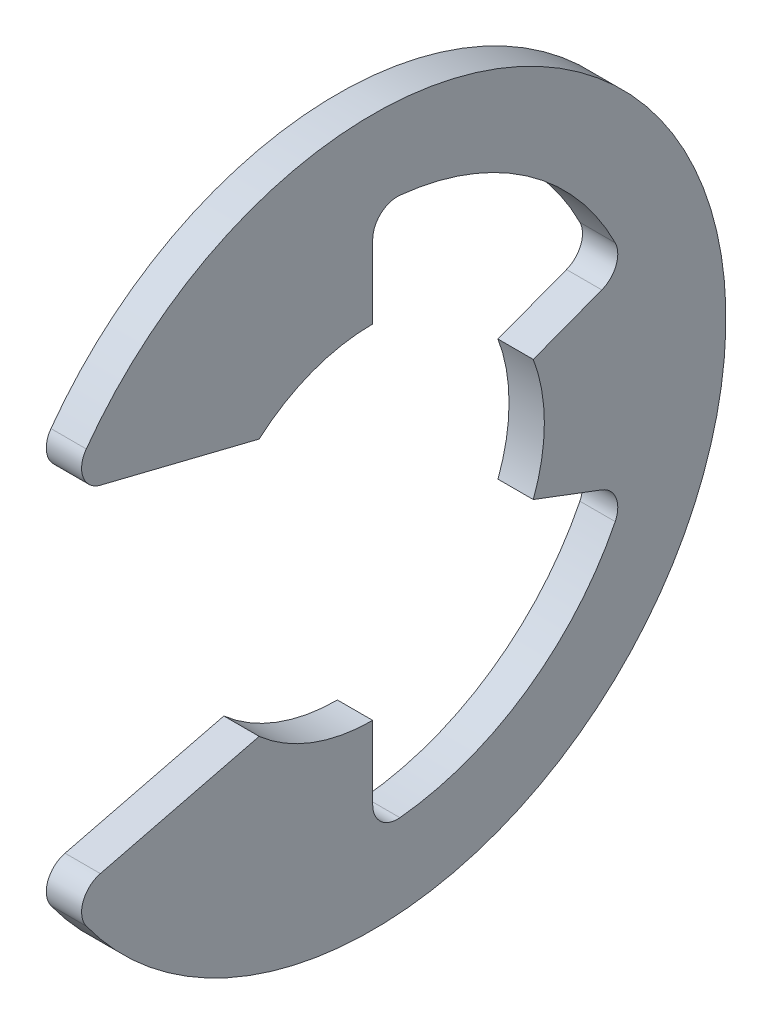
ISO-10303-21;
HEADER;
FILE_DESCRIPTION(('STEP AP214'),'2;1');
FILE_NAME('part.step','',(''),(''),'','','');
FILE_SCHEMA(('AUTOMOTIVE_DESIGN { 1 0 10303 214 1 1 1 1 }'));
ENDSEC;
DATA;
#1=APPLICATION_CONTEXT('core data for automotive mechanical design processes');
#2=APPLICATION_PROTOCOL_DEFINITION('international standard','automotive_design',2000,#1);
#3=PRODUCT_CONTEXT('',#1,'mechanical');
#4=PRODUCT('Part','Part','',(#3));
#5=PRODUCT_RELATED_PRODUCT_CATEGORY('part','',(#4));
#6=PRODUCT_DEFINITION_FORMATION('','',#4);
#7=PRODUCT_DEFINITION_CONTEXT('part definition',#1,'design');
#8=PRODUCT_DEFINITION('design','',#6,#7);
#9=PRODUCT_DEFINITION_SHAPE('','',#8);
#10=(LENGTH_UNIT() NAMED_UNIT(*) SI_UNIT(.MILLI.,.METRE.));
#11=(NAMED_UNIT(*) PLANE_ANGLE_UNIT() SI_UNIT($,.RADIAN.));
#12=(NAMED_UNIT(*) SI_UNIT($,.STERADIAN.) SOLID_ANGLE_UNIT());
#13=UNCERTAINTY_MEASURE_WITH_UNIT(LENGTH_MEASURE(1.E-05),#10,'distance_accuracy_value','');
#14=(GEOMETRIC_REPRESENTATION_CONTEXT(3) GLOBAL_UNCERTAINTY_ASSIGNED_CONTEXT((#13)) GLOBAL_UNIT_ASSIGNED_CONTEXT((#10,
#11,#12)) REPRESENTATION_CONTEXT('',''));
#15=CARTESIAN_POINT('',(0.,0.,0.));
#16=DIRECTION('',(0.,0.,1.));
#17=DIRECTION('',(1.,0.,0.));
#18=AXIS2_PLACEMENT_3D('',#15,#16,#17);
#19=CARTESIAN_POINT('',(0.3175,0.,0.));
#20=DIRECTION('',(1.,0.,0.));
#21=DIRECTION('',(0.,0.,-1.));
#22=AXIS2_PLACEMENT_3D('',#19,#20,#21);
#23=PLANE('',#22);
#24=DIRECTION('',(0.,-1.,0.));
#25=VECTOR('',#24,1.);
#26=CARTESIAN_POINT('',(0.3175,-3.0861,0.));
#27=LINE('',#26,#25);
#28=CARTESIAN_POINT('',(0.3175,-4.40336689167331,0.));
#29=VERTEX_POINT('',#28);
#30=CARTESIAN_POINT('',(0.3175,-3.0861,0.));
#31=VERTEX_POINT('',#30);
#32=EDGE_CURVE('E167',#29,#31,#27,.F.);
#33=ORIENTED_EDGE('',*,*,#32,.T.);
#34=CARTESIAN_POINT('',(0.3175,0.,0.));
#35=DIRECTION('',(-1.,0.,0.));
#36=DIRECTION('',(0.,0.,1.));
#37=AXIS2_PLACEMENT_3D('',#34,#35,#36);
#38=CIRCLE('',#37,3.0861);
#39=CARTESIAN_POINT('',(0.3175,-2.314575,2.04126328026911));
#40=VERTEX_POINT('',#39);
#41=EDGE_CURVE('E223',#31,#40,#38,.T.);
#42=ORIENTED_EDGE('',*,*,#41,.T.);
#43=DIRECTION('',(0.,0.240952820606873,-0.970536829925373));
#44=VECTOR('',#43,1.);
#45=CARTESIAN_POINT('',(0.3175,-3.17332392884383,5.5002286536677));
#46=LINE('',#45,#44);
#47=CARTESIAN_POINT('',(0.3175,-3.02345270202051,4.89656049567819));
#48=VERTEX_POINT('',#47);
#49=EDGE_CURVE('E162',#40,#48,#46,.F.);
#50=ORIENTED_EDGE('',*,*,#49,.T.);
#51=CARTESIAN_POINT('',(0.3175,-3.45485632292234,4.78945696691844));
#52=DIRECTION('',(-1.,0.,0.));
#53=DIRECTION('',(0.,0.,1.));
#54=AXIS2_PLACEMENT_3D('',#51,#52,#53);
#55=CIRCLE('',#54,0.4445);
#56=CARTESIAN_POINT('',(0.3175,-3.7148992719595,5.14995372786929));
#57=VERTEX_POINT('',#56);
#58=EDGE_CURVE('E221',#57,#48,#55,.T.);
#59=ORIENTED_EDGE('',*,*,#58,.F.);
#60=CARTESIAN_POINT('',(0.3175,0.,0.));
#61=DIRECTION('',(-1.,0.,0.));
#62=DIRECTION('',(0.,0.,1.));
#63=AXIS2_PLACEMENT_3D('',#60,#61,#62);
#64=CIRCLE('',#63,6.35);
#65=CARTESIAN_POINT('',(0.3175,3.7148992719595,5.14995372786929));
#66=VERTEX_POINT('',#65);
#67=EDGE_CURVE('E142',#66,#57,#64,.T.);
#68=ORIENTED_EDGE('',*,*,#67,.F.);
#69=CARTESIAN_POINT('',(0.3175,3.45485632292234,4.78945696691844));
#70=DIRECTION('',(-1.,0.,0.));
#71=DIRECTION('',(0.,0.,1.));
#72=AXIS2_PLACEMENT_3D('',#69,#70,#71);
#73=CIRCLE('',#72,0.4445);
#74=CARTESIAN_POINT('',(0.3175,3.02345270202051,4.89656049567819));
#75=VERTEX_POINT('',#74);
#76=EDGE_CURVE('E20',#75,#66,#73,.T.);
#77=ORIENTED_EDGE('',*,*,#76,.F.);
#78=DIRECTION('',(0.,0.240952820606873,0.970536829925373));
#79=VECTOR('',#78,1.);
#80=CARTESIAN_POINT('',(0.3175,3.17332392884382,5.5002286536677));
#81=LINE('',#80,#79);
#82=CARTESIAN_POINT('',(0.3175,2.314575,2.04126328026911));
#83=VERTEX_POINT('',#82);
#84=EDGE_CURVE('E139',#75,#83,#81,.F.);
#85=ORIENTED_EDGE('',*,*,#84,.T.);
#86=CARTESIAN_POINT('',(0.3175,0.,0.));
#87=DIRECTION('',(-1.,0.,0.));
#88=DIRECTION('',(0.,0.,1.));
#89=AXIS2_PLACEMENT_3D('',#86,#87,#88);
#90=CIRCLE('',#89,3.0861);
#91=CARTESIAN_POINT('',(0.3175,3.0861,0.));
#92=VERTEX_POINT('',#91);
#93=EDGE_CURVE('E242',#83,#92,#90,.T.);
#94=ORIENTED_EDGE('',*,*,#93,.T.);
#95=DIRECTION('',(0.,-1.,0.));
#96=VECTOR('',#95,1.);
#97=CARTESIAN_POINT('',(0.3175,3.0861,0.));
#98=LINE('',#97,#96);
#99=CARTESIAN_POINT('',(0.3175,4.40336689167331,0.));
#100=VERTEX_POINT('',#99);
#101=EDGE_CURVE('E179',#92,#100,#98,.F.);
#102=ORIENTED_EDGE('',*,*,#101,.T.);
#103=CARTESIAN_POINT('',(0.3175,4.40336689167331,-0.444499999999999));
#104=DIRECTION('',(-1.,0.,0.));
#105=DIRECTION('',(0.,0.,1.));
#106=AXIS2_PLACEMENT_3D('',#103,#104,#105);
#107=CIRCLE('',#106,0.4445);
#108=CARTESIAN_POINT('',(0.3175,4.84561932872465,-0.489143386096454));
#109=VERTEX_POINT('',#108);
#110=EDGE_CURVE('E241',#100,#109,#107,.T.);
#111=ORIENTED_EDGE('',*,*,#110,.T.);
#112=CARTESIAN_POINT('',(0.3175,0.,0.));
#113=DIRECTION('',(-1.,0.,0.));
#114=DIRECTION('',(0.,0.,1.));
#115=AXIS2_PLACEMENT_3D('',#112,#113,#114);
#116=CIRCLE('',#115,4.87024516129032);
#117=CARTESIAN_POINT('',(0.3175,2.17073688413976,-4.35972353606361));
#118=VERTEX_POINT('',#117);
#119=EDGE_CURVE('E238',#109,#118,#116,.T.);
#120=ORIENTED_EDGE('',*,*,#119,.T.);
#121=CARTESIAN_POINT('',(0.3175,1.97261697168252,-3.96181808210761));
#122=DIRECTION('',(-1.,0.,0.));
#123=DIRECTION('',(0.,0.,1.));
#124=AXIS2_PLACEMENT_3D('',#121,#122,#123);
#125=CIRCLE('',#124,0.4445);
#126=CARTESIAN_POINT('',(0.3175,1.55682529457727,-4.11897256422632));
#127=VERTEX_POINT('',#126);
#128=EDGE_CURVE('E235',#118,#127,#125,.T.);
#129=ORIENTED_EDGE('',*,*,#128,.T.);
#130=DIRECTION('',(0.,0.353553390593274,-0.935414346693485));
#131=VECTOR('',#130,1.);
#132=CARTESIAN_POINT('',(0.3175,1.0911011187099,-2.88678221533076));
#133=LINE('',#132,#131);
#134=CARTESIAN_POINT('',(0.3175,1.0911011187099,-2.88678221533077));
#135=VERTEX_POINT('',#134);
#136=EDGE_CURVE('E175',#127,#135,#133,.F.);
#137=ORIENTED_EDGE('',*,*,#136,.T.);
#138=CARTESIAN_POINT('',(0.3175,0.,0.));
#139=DIRECTION('',(-1.,0.,0.));
#140=DIRECTION('',(0.,0.,1.));
#141=AXIS2_PLACEMENT_3D('',#138,#139,#140);
#142=CIRCLE('',#141,3.0861);
#143=CARTESIAN_POINT('',(0.3175,-1.0911011187099,-2.88678221533077));
#144=VERTEX_POINT('',#143);
#145=EDGE_CURVE('E233',#135,#144,#142,.T.);
#146=ORIENTED_EDGE('',*,*,#145,.T.);
#147=DIRECTION('',(0.,0.353553390593274,0.935414346693485));
#148=VECTOR('',#147,1.);
#149=CARTESIAN_POINT('',(0.3175,-1.0911011187099,-2.88678221533077));
#150=LINE('',#149,#148);
#151=CARTESIAN_POINT('',(0.3175,-1.55682529457726,-4.11897256422632));
#152=VERTEX_POINT('',#151);
#153=EDGE_CURVE('E171',#144,#152,#150,.F.);
#154=ORIENTED_EDGE('',*,*,#153,.T.);
#155=CARTESIAN_POINT('',(0.3175,-1.97261697168252,-3.96181808210761));
#156=DIRECTION('',(-1.,0.,0.));
#157=DIRECTION('',(0.,0.,1.));
#158=AXIS2_PLACEMENT_3D('',#155,#156,#157);
#159=CIRCLE('',#158,0.4445);
#160=CARTESIAN_POINT('',(0.3175,-2.17073688413975,-4.35972353606361));
#161=VERTEX_POINT('',#160);
#162=EDGE_CURVE('E231',#152,#161,#159,.T.);
#163=ORIENTED_EDGE('',*,*,#162,.T.);
#164=CARTESIAN_POINT('',(0.3175,0.,0.));
#165=DIRECTION('',(-1.,0.,0.));
#166=DIRECTION('',(0.,0.,1.));
#167=AXIS2_PLACEMENT_3D('',#164,#165,#166);
#168=CIRCLE('',#167,4.87024516129032);
#169=CARTESIAN_POINT('',(0.3175,-4.84561932872465,-0.489143386096455));
#170=VERTEX_POINT('',#169);
#171=EDGE_CURVE('E228',#161,#170,#168,.T.);
#172=ORIENTED_EDGE('',*,*,#171,.T.);
#173=CARTESIAN_POINT('',(0.3175,-4.40336689167331,-0.4445));
#174=DIRECTION('',(-1.,0.,0.));
#175=DIRECTION('',(0.,0.,1.));
#176=AXIS2_PLACEMENT_3D('',#173,#174,#175);
#177=CIRCLE('',#176,0.4445);
#178=EDGE_CURVE('E225',#170,#29,#177,.T.);
#179=ORIENTED_EDGE('',*,*,#178,.T.);
#180=EDGE_LOOP('',(#33,#42,#50,#59,#68,#77,#85,#94,#102,#111,#120,#129,#137,#146,#154,#163,#172,#179));
#181=FACE_BOUND('',#180,.T.);
#182=ADVANCED_FACE('F17',(#181),#23,.T.);
#183=CARTESIAN_POINT('',(0.3175,3.45485632292234,4.78945696691844));
#184=DIRECTION('',(-1.,0.,0.));
#185=DIRECTION('',(0.,0.,1.));
#186=AXIS2_PLACEMENT_3D('',#183,#184,#185);
#187=CYLINDRICAL_SURFACE('',#186,0.4445);
#188=CARTESIAN_POINT('',(-0.3175,3.45485632292234,4.78945696691844));
#189=DIRECTION('',(-1.,0.,0.));
#190=DIRECTION('',(0.,0.,1.));
#191=AXIS2_PLACEMENT_3D('',#188,#189,#190);
#192=CIRCLE('',#191,0.4445);
#193=CARTESIAN_POINT('',(-0.3175,3.7148992719595,5.14995372786929));
#194=VERTEX_POINT('',#193);
#195=CARTESIAN_POINT('',(-0.3175,3.02345270202051,4.89656049567819));
#196=VERTEX_POINT('',#195);
#197=EDGE_CURVE('E157',#194,#196,#192,.F.);
#198=ORIENTED_EDGE('',*,*,#197,.T.);
#199=DIRECTION('',(1.,0.,0.));
#200=VECTOR('',#199,1.);
#201=CARTESIAN_POINT('',(0.3175,3.02345270202051,4.89656049567819));
#202=LINE('',#201,#200);
#203=EDGE_CURVE('E147',#196,#75,#202,.T.);
#204=ORIENTED_EDGE('',*,*,#203,.T.);
#205=ORIENTED_EDGE('',*,*,#76,.T.);
#206=DIRECTION('',(-1.,0.,0.));
#207=VECTOR('',#206,1.);
#208=CARTESIAN_POINT('',(0.3175,3.7148992719595,5.14995372786929));
#209=LINE('',#208,#207);
#210=EDGE_CURVE('E218',#194,#66,#209,.F.);
#211=ORIENTED_EDGE('',*,*,#210,.F.);
#212=EDGE_LOOP('',(#198,#204,#205,#211));
#213=FACE_BOUND('',#212,.T.);
#214=ADVANCED_FACE('F156',(#213),#187,.T.);
#215=CARTESIAN_POINT('',(0.3175,3.17332392884382,5.5002286536677));
#216=DIRECTION('',(0.,0.970536829925373,-0.240952820606873));
#217=DIRECTION('',(0.,0.240952820606873,0.970536829925373));
#218=AXIS2_PLACEMENT_3D('',#215,#216,#217);
#219=PLANE('',#218);
#220=ORIENTED_EDGE('',*,*,#203,.F.);
#221=DIRECTION('',(0.,-0.240952820606873,-0.970536829925373));
#222=VECTOR('',#221,1.);
#223=CARTESIAN_POINT('',(-0.3175,3.02345270202051,4.89656049567819));
#224=LINE('',#223,#222);
#225=CARTESIAN_POINT('',(-0.3175,2.314575,2.04126328026911));
#226=VERTEX_POINT('',#225);
#227=EDGE_CURVE('E216',#196,#226,#224,.T.);
#228=ORIENTED_EDGE('',*,*,#227,.T.);
#229=DIRECTION('',(-1.,0.,0.));
#230=VECTOR('',#229,1.);
#231=CARTESIAN_POINT('',(0.3175,2.314575,2.04126328026911));
#232=LINE('',#231,#230);
#233=EDGE_CURVE('E154',#226,#83,#232,.F.);
#234=ORIENTED_EDGE('',*,*,#233,.T.);
#235=ORIENTED_EDGE('',*,*,#84,.F.);
#236=EDGE_LOOP('',(#220,#228,#234,#235));
#237=FACE_BOUND('',#236,.T.);
#238=ADVANCED_FACE('F151',(#237),#219,.F.);
#239=CARTESIAN_POINT('',(0.3175,0.,0.));
#240=DIRECTION('',(-1.,0.,0.));
#241=DIRECTION('',(0.,0.,1.));
#242=AXIS2_PLACEMENT_3D('',#239,#240,#241);
#243=CYLINDRICAL_SURFACE('',#242,3.0861);
#244=DIRECTION('',(1.,0.,0.));
#245=VECTOR('',#244,1.);
#246=CARTESIAN_POINT('',(0.3175,3.0861,0.));
#247=LINE('',#246,#245);
#248=CARTESIAN_POINT('',(-0.3175,3.0861,0.));
#249=VERTEX_POINT('',#248);
#250=EDGE_CURVE('E181',#249,#92,#247,.T.);
#251=ORIENTED_EDGE('',*,*,#250,.T.);
#252=ORIENTED_EDGE('',*,*,#93,.F.);
#253=ORIENTED_EDGE('',*,*,#233,.F.);
#254=CARTESIAN_POINT('',(-0.3175,0.,0.));
#255=DIRECTION('',(-1.,0.,0.));
#256=DIRECTION('',(0.,0.,1.));
#257=AXIS2_PLACEMENT_3D('',#254,#255,#256);
#258=CIRCLE('',#257,3.0861);
#259=EDGE_CURVE('E213',#226,#249,#258,.T.);
#260=ORIENTED_EDGE('',*,*,#259,.T.);
#261=EDGE_LOOP('',(#251,#252,#253,#260));
#262=FACE_BOUND('',#261,.T.);
#263=ADVANCED_FACE('F340',(#262),#243,.F.);
#264=CARTESIAN_POINT('',(0.3175,3.0861,0.));
#265=DIRECTION('',(0.,0.,1.));
#266=DIRECTION('',(0.,-1.,0.));
#267=AXIS2_PLACEMENT_3D('',#264,#265,#266);
#268=PLANE('',#267);
#269=DIRECTION('',(-1.,0.,0.));
#270=VECTOR('',#269,1.);
#271=CARTESIAN_POINT('',(0.3175,4.40336689167331,0.));
#272=LINE('',#271,#270);
#273=CARTESIAN_POINT('',(-0.3175,4.40336689167331,0.));
#274=VERTEX_POINT('',#273);
#275=EDGE_CURVE('E180',#274,#100,#272,.F.);
#276=ORIENTED_EDGE('',*,*,#275,.T.);
#277=ORIENTED_EDGE('',*,*,#101,.F.);
#278=ORIENTED_EDGE('',*,*,#250,.F.);
#279=DIRECTION('',(0.,1.,0.));
#280=VECTOR('',#279,1.);
#281=CARTESIAN_POINT('',(-0.3175,0.,0.));
#282=LINE('',#281,#280);
#283=EDGE_CURVE('E212',#249,#274,#282,.T.);
#284=ORIENTED_EDGE('',*,*,#283,.T.);
#285=EDGE_LOOP('',(#276,#277,#278,#284));
#286=FACE_BOUND('',#285,.T.);
#287=ADVANCED_FACE('F338',(#286),#268,.F.);
#288=CARTESIAN_POINT('',(0.3175,4.40336689167331,-0.444499999999999));
#289=DIRECTION('',(-1.,0.,0.));
#290=DIRECTION('',(0.,0.,1.));
#291=AXIS2_PLACEMENT_3D('',#288,#289,#290);
#292=CYLINDRICAL_SURFACE('',#291,0.4445);
#293=ORIENTED_EDGE('',*,*,#275,.F.);
#294=CARTESIAN_POINT('',(-0.3175,4.40336689167331,-0.444499999999999));
#295=DIRECTION('',(-1.,0.,0.));
#296=DIRECTION('',(0.,0.,1.));
#297=AXIS2_PLACEMENT_3D('',#294,#295,#296);
#298=CIRCLE('',#297,0.4445);
#299=CARTESIAN_POINT('',(-0.3175,4.84561932872465,-0.489143386096454));
#300=VERTEX_POINT('',#299);
#301=EDGE_CURVE('E209',#274,#300,#298,.T.);
#302=ORIENTED_EDGE('',*,*,#301,.T.);
#303=DIRECTION('',(-1.,0.,0.));
#304=VECTOR('',#303,1.);
#305=CARTESIAN_POINT('',(0.3175,4.84561932872465,-0.489143386096454));
#306=LINE('',#305,#304);
#307=EDGE_CURVE('E240',#300,#109,#306,.F.);
#308=ORIENTED_EDGE('',*,*,#307,.T.);
#309=ORIENTED_EDGE('',*,*,#110,.F.);
#310=EDGE_LOOP('',(#293,#302,#308,#309));
#311=FACE_BOUND('',#310,.T.);
#312=ADVANCED_FACE('F335',(#311),#292,.F.);
#313=CARTESIAN_POINT('',(0.3175,0.,0.));
#314=DIRECTION('',(-1.,0.,0.));
#315=DIRECTION('',(0.,0.,1.));
#316=AXIS2_PLACEMENT_3D('',#313,#314,#315);
#317=CYLINDRICAL_SURFACE('',#316,4.87024516129032);
#318=ORIENTED_EDGE('',*,*,#307,.F.);
#319=CARTESIAN_POINT('',(-0.3175,0.,0.));
#320=DIRECTION('',(-1.,0.,0.));
#321=DIRECTION('',(0.,0.,1.));
#322=AXIS2_PLACEMENT_3D('',#319,#320,#321);
#323=CIRCLE('',#322,4.87024516129032);
#324=CARTESIAN_POINT('',(-0.3175,2.17073688413976,-4.35972353606361));
#325=VERTEX_POINT('',#324);
#326=EDGE_CURVE('E206',#300,#325,#323,.T.);
#327=ORIENTED_EDGE('',*,*,#326,.T.);
#328=DIRECTION('',(-1.,0.,0.));
#329=VECTOR('',#328,1.);
#330=CARTESIAN_POINT('',(0.3175,2.17073688413976,-4.35972353606361));
#331=LINE('',#330,#329);
#332=EDGE_CURVE('E237',#325,#118,#331,.F.);
#333=ORIENTED_EDGE('',*,*,#332,.T.);
#334=ORIENTED_EDGE('',*,*,#119,.F.);
#335=EDGE_LOOP('',(#318,#327,#333,#334));
#336=FACE_BOUND('',#335,.T.);
#337=ADVANCED_FACE('F331',(#336),#317,.F.);
#338=CARTESIAN_POINT('',(0.3175,1.97261697168252,-3.96181808210761));
#339=DIRECTION('',(-1.,0.,0.));
#340=DIRECTION('',(0.,0.,1.));
#341=AXIS2_PLACEMENT_3D('',#338,#339,#340);
#342=CYLINDRICAL_SURFACE('',#341,0.4445);
#343=ORIENTED_EDGE('',*,*,#332,.F.);
#344=CARTESIAN_POINT('',(-0.3175,1.97261697168252,-3.96181808210761));
#345=DIRECTION('',(-1.,0.,0.));
#346=DIRECTION('',(0.,0.,1.));
#347=AXIS2_PLACEMENT_3D('',#344,#345,#346);
#348=CIRCLE('',#347,0.4445);
#349=CARTESIAN_POINT('',(-0.3175,1.55682529457727,-4.11897256422632));
#350=VERTEX_POINT('',#349);
#351=EDGE_CURVE('E203',#325,#350,#348,.T.);
#352=ORIENTED_EDGE('',*,*,#351,.T.);
#353=DIRECTION('',(1.,0.,0.));
#354=VECTOR('',#353,1.);
#355=CARTESIAN_POINT('',(0.3175,1.55682529457727,-4.11897256422632));
#356=LINE('',#355,#354);
#357=EDGE_CURVE('E178',#350,#127,#356,.T.);
#358=ORIENTED_EDGE('',*,*,#357,.T.);
#359=ORIENTED_EDGE('',*,*,#128,.F.);
#360=EDGE_LOOP('',(#343,#352,#358,#359));
#361=FACE_BOUND('',#360,.T.);
#362=ADVANCED_FACE('F327',(#361),#342,.F.);
#363=CARTESIAN_POINT('',(0.3175,1.0911011187099,-2.88678221533076));
#364=DIRECTION('',(0.,-0.935414346693485,-0.353553390593274));
#365=DIRECTION('',(0.,0.353553390593274,-0.935414346693485));
#366=AXIS2_PLACEMENT_3D('',#363,#364,#365);
#367=PLANE('',#366);
#368=ORIENTED_EDGE('',*,*,#357,.F.);
#369=DIRECTION('',(0.,-0.353553390593274,0.935414346693485));
#370=VECTOR('',#369,1.);
#371=CARTESIAN_POINT('',(-0.3175,1.55682529457727,-4.11897256422632));
#372=LINE('',#371,#370);
#373=CARTESIAN_POINT('',(-0.3175,1.0911011187099,-2.88678221533077));
#374=VERTEX_POINT('',#373);
#375=EDGE_CURVE('E202',#350,#374,#372,.T.);
#376=ORIENTED_EDGE('',*,*,#375,.T.);
#377=DIRECTION('',(-1.,0.,0.));
#378=VECTOR('',#377,1.);
#379=CARTESIAN_POINT('',(0.3175,1.0911011187099,-2.88678221533077));
#380=LINE('',#379,#378);
#381=EDGE_CURVE('E177',#374,#135,#380,.F.);
#382=ORIENTED_EDGE('',*,*,#381,.T.);
#383=ORIENTED_EDGE('',*,*,#136,.F.);
#384=EDGE_LOOP('',(#368,#376,#382,#383));
#385=FACE_BOUND('',#384,.T.);
#386=ADVANCED_FACE('F323',(#385),#367,.F.);
#387=CARTESIAN_POINT('',(0.3175,0.,0.));
#388=DIRECTION('',(-1.,0.,0.));
#389=DIRECTION('',(0.,0.,1.));
#390=AXIS2_PLACEMENT_3D('',#387,#388,#389);
#391=CYLINDRICAL_SURFACE('',#390,3.0861);
#392=DIRECTION('',(1.,0.,0.));
#393=VECTOR('',#392,1.);
#394=CARTESIAN_POINT('',(0.3175,-1.0911011187099,-2.88678221533077));
#395=LINE('',#394,#393);
#396=CARTESIAN_POINT('',(-0.3175,-1.0911011187099,-2.88678221533077));
#397=VERTEX_POINT('',#396);
#398=EDGE_CURVE('E174',#397,#144,#395,.T.);
#399=ORIENTED_EDGE('',*,*,#398,.T.);
#400=ORIENTED_EDGE('',*,*,#145,.F.);
#401=ORIENTED_EDGE('',*,*,#381,.F.);
#402=CARTESIAN_POINT('',(-0.3175,0.,0.));
#403=DIRECTION('',(-1.,0.,0.));
#404=DIRECTION('',(0.,0.,1.));
#405=AXIS2_PLACEMENT_3D('',#402,#403,#404);
#406=CIRCLE('',#405,3.0861);
#407=EDGE_CURVE('E199',#374,#397,#406,.T.);
#408=ORIENTED_EDGE('',*,*,#407,.T.);
#409=EDGE_LOOP('',(#399,#400,#401,#408));
#410=FACE_BOUND('',#409,.T.);
#411=ADVANCED_FACE('F319',(#410),#391,.F.);
#412=CARTESIAN_POINT('',(0.3175,-1.0911011187099,-2.88678221533077));
#413=DIRECTION('',(0.,0.935414346693485,-0.353553390593274));
#414=DIRECTION('',(0.,0.353553390593274,0.935414346693485));
#415=AXIS2_PLACEMENT_3D('',#412,#413,#414);
#416=PLANE('',#415);
#417=DIRECTION('',(-1.,0.,0.));
#418=VECTOR('',#417,1.);
#419=CARTESIAN_POINT('',(0.3175,-1.55682529457726,-4.11897256422632));
#420=LINE('',#419,#418);
#421=CARTESIAN_POINT('',(-0.3175,-1.55682529457726,-4.11897256422632));
#422=VERTEX_POINT('',#421);
#423=EDGE_CURVE('E173',#422,#152,#420,.F.);
#424=ORIENTED_EDGE('',*,*,#423,.T.);
#425=ORIENTED_EDGE('',*,*,#153,.F.);
#426=ORIENTED_EDGE('',*,*,#398,.F.);
#427=DIRECTION('',(0.,-0.353553390593274,-0.935414346693485));
#428=VECTOR('',#427,1.);
#429=CARTESIAN_POINT('',(-0.3175,-1.0911011187099,-2.88678221533077));
#430=LINE('',#429,#428);
#431=EDGE_CURVE('E198',#397,#422,#430,.T.);
#432=ORIENTED_EDGE('',*,*,#431,.T.);
#433=EDGE_LOOP('',(#424,#425,#426,#432));
#434=FACE_BOUND('',#433,.T.);
#435=ADVANCED_FACE('F315',(#434),#416,.F.);
#436=CARTESIAN_POINT('',(0.3175,-1.97261697168252,-3.96181808210761));
#437=DIRECTION('',(-1.,0.,0.));
#438=DIRECTION('',(0.,0.,1.));
#439=AXIS2_PLACEMENT_3D('',#436,#437,#438);
#440=CYLINDRICAL_SURFACE('',#439,0.4445);
#441=ORIENTED_EDGE('',*,*,#423,.F.);
#442=CARTESIAN_POINT('',(-0.3175,-1.97261697168252,-3.96181808210761));
#443=DIRECTION('',(-1.,0.,0.));
#444=DIRECTION('',(0.,0.,1.));
#445=AXIS2_PLACEMENT_3D('',#442,#443,#444);
#446=CIRCLE('',#445,0.4445);
#447=CARTESIAN_POINT('',(-0.3175,-2.17073688413975,-4.35972353606361));
#448=VERTEX_POINT('',#447);
#449=EDGE_CURVE('E195',#422,#448,#446,.T.);
#450=ORIENTED_EDGE('',*,*,#449,.T.);
#451=DIRECTION('',(-1.,0.,0.));
#452=VECTOR('',#451,1.);
#453=CARTESIAN_POINT('',(0.3175,-2.17073688413975,-4.35972353606361));
#454=LINE('',#453,#452);
#455=EDGE_CURVE('E230',#448,#161,#454,.F.);
#456=ORIENTED_EDGE('',*,*,#455,.T.);
#457=ORIENTED_EDGE('',*,*,#162,.F.);
#458=EDGE_LOOP('',(#441,#450,#456,#457));
#459=FACE_BOUND('',#458,.T.);
#460=ADVANCED_FACE('F311',(#459),#440,.F.);
#461=CARTESIAN_POINT('',(0.3175,0.,0.));
#462=DIRECTION('',(-1.,0.,0.));
#463=DIRECTION('',(0.,0.,1.));
#464=AXIS2_PLACEMENT_3D('',#461,#462,#463);
#465=CYLINDRICAL_SURFACE('',#464,4.87024516129032);
#466=DIRECTION('',(-1.,0.,0.));
#467=VECTOR('',#466,1.);
#468=CARTESIAN_POINT('',(0.3175,-4.84561932872465,-0.489143386096455));
#469=LINE('',#468,#467);
#470=CARTESIAN_POINT('',(-0.3175,-4.84561932872465,-0.489143386096455));
#471=VERTEX_POINT('',#470);
#472=EDGE_CURVE('E227',#471,#170,#469,.F.);
#473=ORIENTED_EDGE('',*,*,#472,.T.);
#474=ORIENTED_EDGE('',*,*,#171,.F.);
#475=ORIENTED_EDGE('',*,*,#455,.F.);
#476=CARTESIAN_POINT('',(-0.3175,0.,0.));
#477=DIRECTION('',(-1.,0.,0.));
#478=DIRECTION('',(0.,0.,1.));
#479=AXIS2_PLACEMENT_3D('',#476,#477,#478);
#480=CIRCLE('',#479,4.87024516129032);
#481=EDGE_CURVE('E192',#448,#471,#480,.T.);
#482=ORIENTED_EDGE('',*,*,#481,.T.);
#483=EDGE_LOOP('',(#473,#474,#475,#482));
#484=FACE_BOUND('',#483,.T.);
#485=ADVANCED_FACE('F307',(#484),#465,.F.);
#486=CARTESIAN_POINT('',(0.3175,-4.40336689167331,-0.4445));
#487=DIRECTION('',(-1.,0.,0.));
#488=DIRECTION('',(0.,0.,1.));
#489=AXIS2_PLACEMENT_3D('',#486,#487,#488);
#490=CYLINDRICAL_SURFACE('',#489,0.4445);
#491=ORIENTED_EDGE('',*,*,#472,.F.);
#492=CARTESIAN_POINT('',(-0.3175,-4.40336689167331,-0.4445));
#493=DIRECTION('',(-1.,0.,0.));
#494=DIRECTION('',(0.,0.,1.));
#495=AXIS2_PLACEMENT_3D('',#492,#493,#494);
#496=CIRCLE('',#495,0.4445);
#497=CARTESIAN_POINT('',(-0.3175,-4.40336689167331,0.));
#498=VERTEX_POINT('',#497);
#499=EDGE_CURVE('E189',#471,#498,#496,.T.);
#500=ORIENTED_EDGE('',*,*,#499,.T.);
#501=DIRECTION('',(1.,0.,0.));
#502=VECTOR('',#501,1.);
#503=CARTESIAN_POINT('',(0.3175,-4.40336689167331,0.));
#504=LINE('',#503,#502);
#505=EDGE_CURVE('E170',#498,#29,#504,.T.);
#506=ORIENTED_EDGE('',*,*,#505,.T.);
#507=ORIENTED_EDGE('',*,*,#178,.F.);
#508=EDGE_LOOP('',(#491,#500,#506,#507));
#509=FACE_BOUND('',#508,.T.);
#510=ADVANCED_FACE('F303',(#509),#490,.F.);
#511=CARTESIAN_POINT('',(0.3175,-3.0861,0.));
#512=DIRECTION('',(0.,0.,1.));
#513=DIRECTION('',(0.,-1.,0.));
#514=AXIS2_PLACEMENT_3D('',#511,#512,#513);
#515=PLANE('',#514);
#516=ORIENTED_EDGE('',*,*,#505,.F.);
#517=DIRECTION('',(0.,1.,0.));
#518=VECTOR('',#517,1.);
#519=CARTESIAN_POINT('',(-0.3175,0.,0.));
#520=LINE('',#519,#518);
#521=CARTESIAN_POINT('',(-0.3175,-3.0861,0.));
#522=VERTEX_POINT('',#521);
#523=EDGE_CURVE('E188',#498,#522,#520,.T.);
#524=ORIENTED_EDGE('',*,*,#523,.T.);
#525=DIRECTION('',(-1.,0.,0.));
#526=VECTOR('',#525,1.);
#527=CARTESIAN_POINT('',(0.3175,-3.0861,0.));
#528=LINE('',#527,#526);
#529=EDGE_CURVE('E169',#522,#31,#528,.F.);
#530=ORIENTED_EDGE('',*,*,#529,.T.);
#531=ORIENTED_EDGE('',*,*,#32,.F.);
#532=EDGE_LOOP('',(#516,#524,#530,#531));
#533=FACE_BOUND('',#532,.T.);
#534=ADVANCED_FACE('F299',(#533),#515,.F.);
#535=CARTESIAN_POINT('',(0.3175,0.,0.));
#536=DIRECTION('',(-1.,0.,0.));
#537=DIRECTION('',(0.,0.,1.));
#538=AXIS2_PLACEMENT_3D('',#535,#536,#537);
#539=CYLINDRICAL_SURFACE('',#538,3.0861);
#540=DIRECTION('',(1.,0.,0.));
#541=VECTOR('',#540,1.);
#542=CARTESIAN_POINT('',(0.3175,-2.314575,2.04126328026911));
#543=LINE('',#542,#541);
#544=CARTESIAN_POINT('',(-0.3175,-2.314575,2.04126328026911));
#545=VERTEX_POINT('',#544);
#546=EDGE_CURVE('E166',#545,#40,#543,.T.);
#547=ORIENTED_EDGE('',*,*,#546,.T.);
#548=ORIENTED_EDGE('',*,*,#41,.F.);
#549=ORIENTED_EDGE('',*,*,#529,.F.);
#550=CARTESIAN_POINT('',(-0.3175,0.,0.));
#551=DIRECTION('',(-1.,0.,0.));
#552=DIRECTION('',(0.,0.,1.));
#553=AXIS2_PLACEMENT_3D('',#550,#551,#552);
#554=CIRCLE('',#553,3.0861);
#555=EDGE_CURVE('E185',#522,#545,#554,.T.);
#556=ORIENTED_EDGE('',*,*,#555,.T.);
#557=EDGE_LOOP('',(#547,#548,#549,#556));
#558=FACE_BOUND('',#557,.T.);
#559=ADVANCED_FACE('F295',(#558),#539,.F.);
#560=CARTESIAN_POINT('',(0.3175,-3.17332392884383,5.5002286536677));
#561=DIRECTION('',(0.,-0.970536829925373,-0.240952820606873));
#562=DIRECTION('',(0.,0.240952820606873,-0.970536829925373));
#563=AXIS2_PLACEMENT_3D('',#560,#561,#562);
#564=PLANE('',#563);
#565=DIRECTION('',(-1.,0.,0.));
#566=VECTOR('',#565,1.);
#567=CARTESIAN_POINT('',(0.3175,-3.02345270202051,4.89656049567819));
#568=LINE('',#567,#566);
#569=CARTESIAN_POINT('',(-0.3175,-3.02345270202051,4.89656049567819));
#570=VERTEX_POINT('',#569);
#571=EDGE_CURVE('E165',#48,#570,#568,.T.);
#572=ORIENTED_EDGE('',*,*,#571,.F.);
#573=ORIENTED_EDGE('',*,*,#49,.F.);
#574=ORIENTED_EDGE('',*,*,#546,.F.);
#575=DIRECTION('',(0.,-0.240952820606873,0.970536829925373));
#576=VECTOR('',#575,1.);
#577=CARTESIAN_POINT('',(-0.3175,-2.314575,2.04126328026911));
#578=LINE('',#577,#576);
#579=EDGE_CURVE('E184',#545,#570,#578,.T.);
#580=ORIENTED_EDGE('',*,*,#579,.T.);
#581=EDGE_LOOP('',(#572,#573,#574,#580));
#582=FACE_BOUND('',#581,.T.);
#583=ADVANCED_FACE('F287',(#582),#564,.F.);
#584=CARTESIAN_POINT('',(0.3175,-3.45485632292234,4.78945696691844));
#585=DIRECTION('',(-1.,0.,0.));
#586=DIRECTION('',(0.,0.,1.));
#587=AXIS2_PLACEMENT_3D('',#584,#585,#586);
#588=CYLINDRICAL_SURFACE('',#587,0.4445);
#589=CARTESIAN_POINT('',(-0.3175,-3.45485632292234,4.78945696691844));
#590=DIRECTION('',(-1.,0.,0.));
#591=DIRECTION('',(0.,0.,1.));
#592=AXIS2_PLACEMENT_3D('',#589,#590,#591);
#593=CIRCLE('',#592,0.4445);
#594=CARTESIAN_POINT('',(-0.3175,-3.7148992719595,5.14995372786929));
#595=VERTEX_POINT('',#594);
#596=EDGE_CURVE('E26',#570,#595,#593,.F.);
#597=ORIENTED_EDGE('',*,*,#596,.T.);
#598=DIRECTION('',(-1.,0.,0.));
#599=VECTOR('',#598,1.);
#600=CARTESIAN_POINT('',(0.3175,-3.7148992719595,5.14995372786929));
#601=LINE('',#600,#599);
#602=EDGE_CURVE('E220',#57,#595,#601,.T.);
#603=ORIENTED_EDGE('',*,*,#602,.F.);
#604=ORIENTED_EDGE('',*,*,#58,.T.);
#605=ORIENTED_EDGE('',*,*,#571,.T.);
#606=EDGE_LOOP('',(#597,#603,#604,#605));
#607=FACE_BOUND('',#606,.T.);
#608=ADVANCED_FACE('F356',(#607),#588,.T.);
#609=CARTESIAN_POINT('',(0.3175,0.,0.));
#610=DIRECTION('',(-1.,0.,0.));
#611=DIRECTION('',(0.,0.,1.));
#612=AXIS2_PLACEMENT_3D('',#609,#610,#611);
#613=CYLINDRICAL_SURFACE('',#612,6.35);
#614=CARTESIAN_POINT('',(-0.3175,0.,0.));
#615=DIRECTION('',(-1.,0.,0.));
#616=DIRECTION('',(0.,0.,1.));
#617=AXIS2_PLACEMENT_3D('',#614,#615,#616);
#618=CIRCLE('',#617,6.35);
#619=EDGE_CURVE('E11',#595,#194,#618,.F.);
#620=ORIENTED_EDGE('',*,*,#619,.T.);
#621=ORIENTED_EDGE('',*,*,#210,.T.);
#622=ORIENTED_EDGE('',*,*,#67,.T.);
#623=ORIENTED_EDGE('',*,*,#602,.T.);
#624=EDGE_LOOP('',(#620,#621,#622,#623));
#625=FACE_BOUND('',#624,.T.);
#626=ADVANCED_FACE('F351',(#625),#613,.T.);
#627=CARTESIAN_POINT('',(-0.3175,0.,0.));
#628=DIRECTION('',(1.,0.,0.));
#629=DIRECTION('',(0.,0.,-1.));
#630=AXIS2_PLACEMENT_3D('',#627,#628,#629);
#631=PLANE('',#630);
#632=ORIENTED_EDGE('',*,*,#619,.F.);
#633=ORIENTED_EDGE('',*,*,#596,.F.);
#634=ORIENTED_EDGE('',*,*,#579,.F.);
#635=ORIENTED_EDGE('',*,*,#555,.F.);
#636=ORIENTED_EDGE('',*,*,#523,.F.);
#637=ORIENTED_EDGE('',*,*,#499,.F.);
#638=ORIENTED_EDGE('',*,*,#481,.F.);
#639=ORIENTED_EDGE('',*,*,#449,.F.);
#640=ORIENTED_EDGE('',*,*,#431,.F.);
#641=ORIENTED_EDGE('',*,*,#407,.F.);
#642=ORIENTED_EDGE('',*,*,#375,.F.);
#643=ORIENTED_EDGE('',*,*,#351,.F.);
#644=ORIENTED_EDGE('',*,*,#326,.F.);
#645=ORIENTED_EDGE('',*,*,#301,.F.);
#646=ORIENTED_EDGE('',*,*,#283,.F.);
#647=ORIENTED_EDGE('',*,*,#259,.F.);
#648=ORIENTED_EDGE('',*,*,#227,.F.);
#649=ORIENTED_EDGE('',*,*,#197,.F.);
#650=EDGE_LOOP('',(#632,#633,#634,#635,#636,#637,#638,#639,#640,#641,#642,#643,#644,#645,#646,
#647,#648,#649));
#651=FACE_BOUND('',#650,.T.);
#652=ADVANCED_FACE('F292',(#651),#631,.F.);
#653=CLOSED_SHELL('',(#182,#214,#238,#263,#287,#312,#337,#362,#386,#411,#435,#460,#485,#510,
#534,#559,#583,#608,#626,#652));
#654=MANIFOLD_SOLID_BREP('B1',#653);
#655=ADVANCED_BREP_SHAPE_REPRESENTATION('',(#18,#654),#14);
#656=SHAPE_DEFINITION_REPRESENTATION(#9,#655);
ENDSEC;
END-ISO-10303-21;
